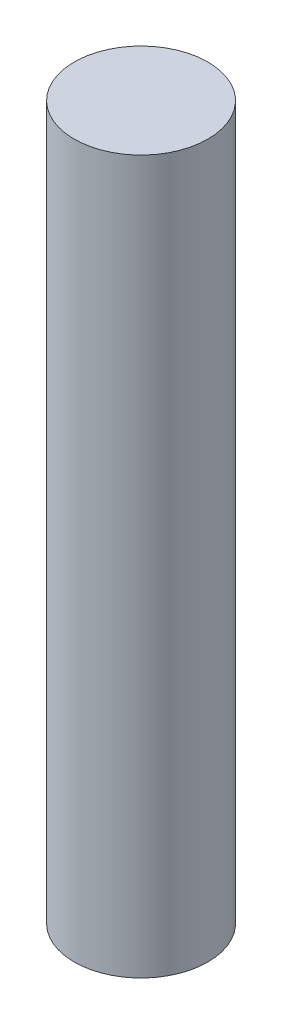
ISO-10303-21;
HEADER;
FILE_DESCRIPTION(('STEP AP214'),'2;1');
FILE_NAME('part.step','',(''),(''),'','','');
FILE_SCHEMA(('AUTOMOTIVE_DESIGN { 1 0 10303 214 1 1 1 1 }'));
ENDSEC;
DATA;
#1=APPLICATION_CONTEXT('core data for automotive mechanical design processes');
#2=APPLICATION_PROTOCOL_DEFINITION('international standard','automotive_design',2000,#1);
#3=PRODUCT_CONTEXT('',#1,'mechanical');
#4=PRODUCT('Part','Part','',(#3));
#5=PRODUCT_RELATED_PRODUCT_CATEGORY('part','',(#4));
#6=PRODUCT_DEFINITION_FORMATION('','',#4);
#7=PRODUCT_DEFINITION_CONTEXT('part definition',#1,'design');
#8=PRODUCT_DEFINITION('design','',#6,#7);
#9=PRODUCT_DEFINITION_SHAPE('','',#8);
#10=(LENGTH_UNIT() NAMED_UNIT(*) SI_UNIT(.MILLI.,.METRE.));
#11=(NAMED_UNIT(*) PLANE_ANGLE_UNIT() SI_UNIT($,.RADIAN.));
#12=(NAMED_UNIT(*) SI_UNIT($,.STERADIAN.) SOLID_ANGLE_UNIT());
#13=UNCERTAINTY_MEASURE_WITH_UNIT(LENGTH_MEASURE(1.E-05),#10,'distance_accuracy_value','');
#14=(GEOMETRIC_REPRESENTATION_CONTEXT(3) GLOBAL_UNCERTAINTY_ASSIGNED_CONTEXT((#13)) GLOBAL_UNIT_ASSIGNED_CONTEXT((#10,
#11,#12)) REPRESENTATION_CONTEXT('',''));
#15=CARTESIAN_POINT('',(0.,0.,0.));
#16=DIRECTION('',(0.,0.,1.));
#17=DIRECTION('',(1.,0.,0.));
#18=AXIS2_PLACEMENT_3D('',#15,#16,#17);
#19=CARTESIAN_POINT('',(0.,20.,0.));
#20=DIRECTION('',(0.,-1.,0.));
#21=DIRECTION('',(1.,0.,0.));
#22=AXIS2_PLACEMENT_3D('',#19,#20,#21);
#23=CYLINDRICAL_SURFACE('',#22,4.5);
#24=CARTESIAN_POINT('',(0.,20.,0.));
#25=DIRECTION('',(0.,-1.,0.));
#26=DIRECTION('',(1.,0.,0.));
#27=AXIS2_PLACEMENT_3D('',#24,#25,#26);
#28=CIRCLE('',#27,4.5);
#29=CARTESIAN_POINT('',(4.5,20.,0.));
#30=VERTEX_POINT('',#29);
#31=EDGE_CURVE('E10',#30,#30,#28,.T.);
#32=ORIENTED_EDGE('',*,*,#31,.T.);
#33=EDGE_LOOP('',(#32));
#34=FACE_BOUND('',#33,.T.);
#35=CARTESIAN_POINT('',(0.,-28.,0.));
#36=DIRECTION('',(0.,-1.,0.));
#37=DIRECTION('',(1.,0.,0.));
#38=AXIS2_PLACEMENT_3D('',#35,#36,#37);
#39=CIRCLE('',#38,4.5);
#40=CARTESIAN_POINT('',(4.5,-28.,0.));
#41=VERTEX_POINT('',#40);
#42=EDGE_CURVE('E22',#41,#41,#39,.T.);
#43=ORIENTED_EDGE('',*,*,#42,.F.);
#44=EDGE_LOOP('',(#43));
#45=FACE_BOUND('',#44,.T.);
#46=ADVANCED_FACE('F15',(#34,#45),#23,.T.);
#47=CARTESIAN_POINT('',(0.,20.,0.));
#48=DIRECTION('',(0.,-1.,0.));
#49=DIRECTION('',(1.,0.,0.));
#50=AXIS2_PLACEMENT_3D('',#47,#48,#49);
#51=PLANE('',#50);
#52=ORIENTED_EDGE('',*,*,#31,.F.);
#53=EDGE_LOOP('',(#52));
#54=FACE_BOUND('',#53,.T.);
#55=ADVANCED_FACE('F36',(#54),#51,.F.);
#56=CARTESIAN_POINT('',(0.,-28.,0.));
#57=DIRECTION('',(0.,-1.,0.));
#58=DIRECTION('',(1.,0.,0.));
#59=AXIS2_PLACEMENT_3D('',#56,#57,#58);
#60=PLANE('',#59);
#61=ORIENTED_EDGE('',*,*,#42,.T.);
#62=EDGE_LOOP('',(#61));
#63=FACE_BOUND('',#62,.T.);
#64=ADVANCED_FACE('F33',(#63),#60,.T.);
#65=CLOSED_SHELL('',(#46,#55,#64));
#66=MANIFOLD_SOLID_BREP('B1',#65);
#67=ADVANCED_BREP_SHAPE_REPRESENTATION('',(#18,#66),#14);
#68=SHAPE_DEFINITION_REPRESENTATION(#9,#67);
ENDSEC;
END-ISO-10303-21;
